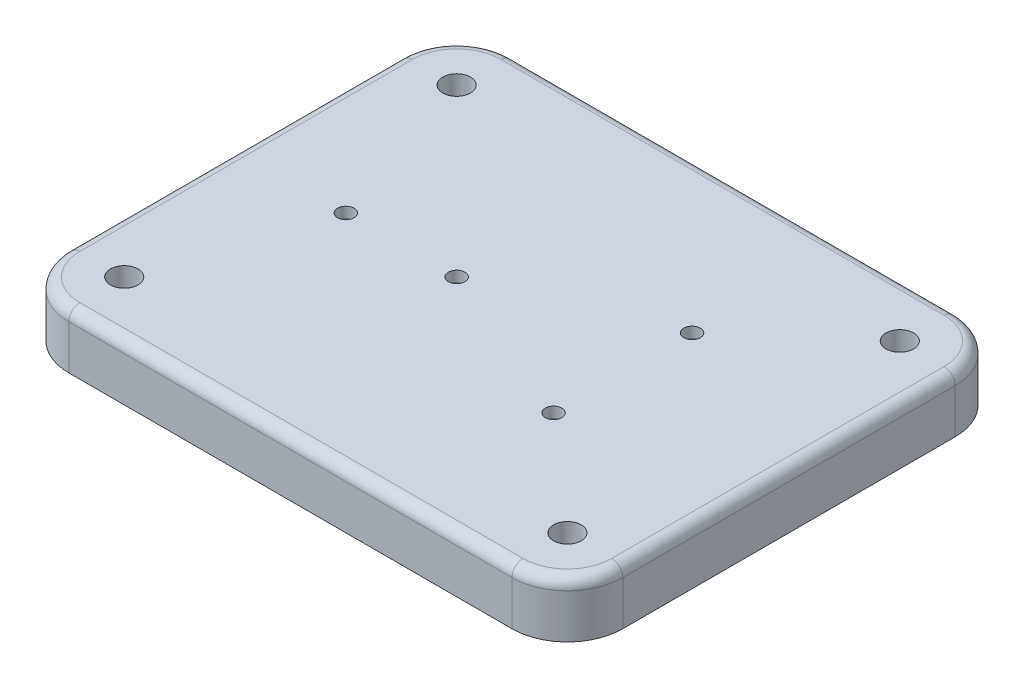
ISO-10303-21;
HEADER;
FILE_DESCRIPTION(('STEP AP214'),'2;1');
FILE_NAME('part.step','',(''),(''),'','','');
FILE_SCHEMA(('AUTOMOTIVE_DESIGN { 1 0 10303 214 1 1 1 1 }'));
ENDSEC;
DATA;
#1=APPLICATION_CONTEXT('core data for automotive mechanical design processes');
#2=APPLICATION_PROTOCOL_DEFINITION('international standard','automotive_design',2000,#1);
#3=PRODUCT_CONTEXT('',#1,'mechanical');
#4=PRODUCT('Part','Part','',(#3));
#5=PRODUCT_RELATED_PRODUCT_CATEGORY('part','',(#4));
#6=PRODUCT_DEFINITION_FORMATION('','',#4);
#7=PRODUCT_DEFINITION_CONTEXT('part definition',#1,'design');
#8=PRODUCT_DEFINITION('design','',#6,#7);
#9=PRODUCT_DEFINITION_SHAPE('','',#8);
#10=(LENGTH_UNIT() NAMED_UNIT(*) SI_UNIT(.MILLI.,.METRE.));
#11=(NAMED_UNIT(*) PLANE_ANGLE_UNIT() SI_UNIT($,.RADIAN.));
#12=(NAMED_UNIT(*) SI_UNIT($,.STERADIAN.) SOLID_ANGLE_UNIT());
#13=UNCERTAINTY_MEASURE_WITH_UNIT(LENGTH_MEASURE(1.E-05),#10,'distance_accuracy_value','');
#14=(GEOMETRIC_REPRESENTATION_CONTEXT(3) GLOBAL_UNCERTAINTY_ASSIGNED_CONTEXT((#13)) GLOBAL_UNIT_ASSIGNED_CONTEXT((#10,
#11,#12)) REPRESENTATION_CONTEXT('',''));
#15=CARTESIAN_POINT('',(0.,0.,0.));
#16=DIRECTION('',(0.,0.,1.));
#17=DIRECTION('',(1.,0.,0.));
#18=AXIS2_PLACEMENT_3D('',#15,#16,#17);
#19=CARTESIAN_POINT('',(0.,0.,0.));
#20=DIRECTION('',(0.,1.,0.));
#21=DIRECTION('',(0.,0.,1.));
#22=AXIS2_PLACEMENT_3D('',#19,#20,#21);
#23=PLANE('',#22);
#24=CARTESIAN_POINT('',(40.,0.,30.));
#25=DIRECTION('',(0.,1.,0.));
#26=DIRECTION('',(0.,0.,1.));
#27=AXIS2_PLACEMENT_3D('',#24,#25,#26);
#28=CIRCLE('',#27,4.5);
#29=CARTESIAN_POINT('',(40.,0.,34.5));
#30=VERTEX_POINT('',#29);
#31=EDGE_CURVE('E238',#30,#30,#28,.T.);
#32=ORIENTED_EDGE('',*,*,#31,.F.);
#33=EDGE_LOOP('',(#32));
#34=FACE_BOUND('',#33,.T.);
#35=CARTESIAN_POINT('',(40.,0.,30.));
#36=DIRECTION('',(0.,1.,0.));
#37=DIRECTION('',(0.,0.,1.));
#38=AXIS2_PLACEMENT_3D('',#35,#36,#37);
#39=CIRCLE('',#38,2.5);
#40=CARTESIAN_POINT('',(40.,0.,32.5));
#41=VERTEX_POINT('',#40);
#42=EDGE_CURVE('E325',#41,#41,#39,.T.);
#43=ORIENTED_EDGE('',*,*,#42,.T.);
#44=EDGE_LOOP('',(#43));
#45=FACE_BOUND('',#44,.T.);
#46=ADVANCED_FACE('F38',(#34,#45),#23,.F.);
#47=CARTESIAN_POINT('',(-40.,0.,30.));
#48=DIRECTION('',(0.,1.,0.));
#49=DIRECTION('',(0.,0.,1.));
#50=AXIS2_PLACEMENT_3D('',#47,#48,#49);
#51=CIRCLE('',#50,4.5);
#52=CARTESIAN_POINT('',(-40.,0.,34.5));
#53=VERTEX_POINT('',#52);
#54=EDGE_CURVE('E243',#53,#53,#51,.T.);
#55=ORIENTED_EDGE('',*,*,#54,.F.);
#56=EDGE_LOOP('',(#55));
#57=FACE_BOUND('',#56,.T.);
#58=CARTESIAN_POINT('',(-40.,0.,30.));
#59=DIRECTION('',(0.,1.,0.));
#60=DIRECTION('',(0.,0.,1.));
#61=AXIS2_PLACEMENT_3D('',#58,#59,#60);
#62=CIRCLE('',#61,2.5);
#63=CARTESIAN_POINT('',(-40.,0.,32.5));
#64=VERTEX_POINT('',#63);
#65=EDGE_CURVE('E317',#64,#64,#62,.T.);
#66=ORIENTED_EDGE('',*,*,#65,.T.);
#67=EDGE_LOOP('',(#66));
#68=FACE_BOUND('',#67,.T.);
#69=ADVANCED_FACE('F501',(#57,#68),#23,.F.);
#70=CARTESIAN_POINT('',(-40.,0.,-30.));
#71=DIRECTION('',(0.,1.,0.));
#72=DIRECTION('',(0.,0.,1.));
#73=AXIS2_PLACEMENT_3D('',#70,#71,#72);
#74=CIRCLE('',#73,4.5);
#75=CARTESIAN_POINT('',(-40.,0.,-25.5));
#76=VERTEX_POINT('',#75);
#77=EDGE_CURVE('E248',#76,#76,#74,.T.);
#78=ORIENTED_EDGE('',*,*,#77,.F.);
#79=EDGE_LOOP('',(#78));
#80=FACE_BOUND('',#79,.T.);
#81=CARTESIAN_POINT('',(-40.,0.,-30.));
#82=DIRECTION('',(0.,1.,0.));
#83=DIRECTION('',(0.,0.,1.));
#84=AXIS2_PLACEMENT_3D('',#81,#82,#83);
#85=CIRCLE('',#84,2.5);
#86=CARTESIAN_POINT('',(-40.,0.,-27.5));
#87=VERTEX_POINT('',#86);
#88=EDGE_CURVE('E308',#87,#87,#85,.T.);
#89=ORIENTED_EDGE('',*,*,#88,.T.);
#90=EDGE_LOOP('',(#89));
#91=FACE_BOUND('',#90,.T.);
#92=ADVANCED_FACE('F509',(#80,#91),#23,.F.);
#93=DIRECTION('',(-1.,0.,0.));
#94=VECTOR('',#93,1.);
#95=CARTESIAN_POINT('',(-50.,0.,-40.));
#96=LINE('',#95,#94);
#97=CARTESIAN_POINT('',(40.,0.,-40.));
#98=VERTEX_POINT('',#97);
#99=CARTESIAN_POINT('',(-40.,0.,-40.));
#100=VERTEX_POINT('',#99);
#101=EDGE_CURVE('E345',#98,#100,#96,.T.);
#102=ORIENTED_EDGE('',*,*,#101,.F.);
#103=CARTESIAN_POINT('',(40.,0.,-30.));
#104=DIRECTION('',(0.,1.,0.));
#105=DIRECTION('',(0.,0.,1.));
#106=AXIS2_PLACEMENT_3D('',#103,#104,#105);
#107=CIRCLE('',#106,10.);
#108=CARTESIAN_POINT('',(50.,0.,-30.));
#109=VERTEX_POINT('',#108);
#110=EDGE_CURVE('E372',#98,#109,#107,.F.);
#111=ORIENTED_EDGE('',*,*,#110,.T.);
#112=DIRECTION('',(0.,0.,-1.));
#113=VECTOR('',#112,1.);
#114=CARTESIAN_POINT('',(50.,0.,-40.));
#115=LINE('',#114,#113);
#116=CARTESIAN_POINT('',(50.,0.,30.));
#117=VERTEX_POINT('',#116);
#118=EDGE_CURVE('E338',#117,#109,#115,.T.);
#119=ORIENTED_EDGE('',*,*,#118,.F.);
#120=CARTESIAN_POINT('',(40.,0.,30.));
#121=DIRECTION('',(0.,1.,0.));
#122=DIRECTION('',(0.,0.,1.));
#123=AXIS2_PLACEMENT_3D('',#120,#121,#122);
#124=CIRCLE('',#123,10.);
#125=CARTESIAN_POINT('',(40.,0.,40.));
#126=VERTEX_POINT('',#125);
#127=EDGE_CURVE('E369',#117,#126,#124,.F.);
#128=ORIENTED_EDGE('',*,*,#127,.T.);
#129=DIRECTION('',(1.,0.,0.));
#130=VECTOR('',#129,1.);
#131=CARTESIAN_POINT('',(-50.,0.,40.));
#132=LINE('',#131,#130);
#133=CARTESIAN_POINT('',(-40.,0.,40.));
#134=VERTEX_POINT('',#133);
#135=EDGE_CURVE('E353',#134,#126,#132,.T.);
#136=ORIENTED_EDGE('',*,*,#135,.F.);
#137=CARTESIAN_POINT('',(-40.,0.,30.));
#138=DIRECTION('',(0.,1.,0.));
#139=DIRECTION('',(0.,0.,1.));
#140=AXIS2_PLACEMENT_3D('',#137,#138,#139);
#141=CIRCLE('',#140,10.);
#142=CARTESIAN_POINT('',(-50.,0.,30.));
#143=VERTEX_POINT('',#142);
#144=EDGE_CURVE('E366',#134,#143,#141,.F.);
#145=ORIENTED_EDGE('',*,*,#144,.T.);
#146=DIRECTION('',(0.,0.,1.));
#147=VECTOR('',#146,1.);
#148=CARTESIAN_POINT('',(-50.,0.,-40.));
#149=LINE('',#148,#147);
#150=CARTESIAN_POINT('',(-50.,0.,-30.));
#151=VERTEX_POINT('',#150);
#152=EDGE_CURVE('E349',#151,#143,#149,.T.);
#153=ORIENTED_EDGE('',*,*,#152,.F.);
#154=CARTESIAN_POINT('',(-40.,0.,-30.));
#155=DIRECTION('',(0.,1.,0.));
#156=DIRECTION('',(0.,0.,1.));
#157=AXIS2_PLACEMENT_3D('',#154,#155,#156);
#158=CIRCLE('',#157,10.);
#159=EDGE_CURVE('E363',#151,#100,#158,.F.);
#160=ORIENTED_EDGE('',*,*,#159,.T.);
#161=EDGE_LOOP('',(#102,#111,#119,#128,#136,#145,#153,#160));
#162=FACE_BOUND('',#161,.T.);
#163=CARTESIAN_POINT('',(40.,0.,-30.));
#164=DIRECTION('',(0.,1.,0.));
#165=DIRECTION('',(0.,0.,1.));
#166=AXIS2_PLACEMENT_3D('',#163,#164,#165);
#167=CIRCLE('',#166,8.);
#168=CARTESIAN_POINT('',(40.,0.,-38.));
#169=VERTEX_POINT('',#168);
#170=CARTESIAN_POINT('',(48.,0.,-30.));
#171=VERTEX_POINT('',#170);
#172=EDGE_CURVE('E185',#169,#171,#167,.F.);
#173=ORIENTED_EDGE('',*,*,#172,.F.);
#174=DIRECTION('',(-1.,0.,0.));
#175=VECTOR('',#174,1.);
#176=CARTESIAN_POINT('',(-50.,0.,-38.));
#177=LINE('',#176,#175);
#178=CARTESIAN_POINT('',(-40.,0.,-38.));
#179=VERTEX_POINT('',#178);
#180=EDGE_CURVE('E277',#169,#179,#177,.T.);
#181=ORIENTED_EDGE('',*,*,#180,.T.);
#182=CARTESIAN_POINT('',(-40.,0.,-30.));
#183=DIRECTION('',(0.,1.,0.));
#184=DIRECTION('',(0.,0.,1.));
#185=AXIS2_PLACEMENT_3D('',#182,#183,#184);
#186=CIRCLE('',#185,8.);
#187=CARTESIAN_POINT('',(-48.,0.,-30.));
#188=VERTEX_POINT('',#187);
#189=EDGE_CURVE('E262',#188,#179,#186,.F.);
#190=ORIENTED_EDGE('',*,*,#189,.F.);
#191=DIRECTION('',(0.,0.,1.));
#192=VECTOR('',#191,1.);
#193=CARTESIAN_POINT('',(-48.,0.,-40.));
#194=LINE('',#193,#192);
#195=CARTESIAN_POINT('',(-48.,0.,30.));
#196=VERTEX_POINT('',#195);
#197=EDGE_CURVE('E56',#188,#196,#194,.T.);
#198=ORIENTED_EDGE('',*,*,#197,.T.);
#199=CARTESIAN_POINT('',(-40.,0.,30.));
#200=DIRECTION('',(0.,1.,0.));
#201=DIRECTION('',(0.,0.,1.));
#202=AXIS2_PLACEMENT_3D('',#199,#200,#201);
#203=CIRCLE('',#202,8.);
#204=CARTESIAN_POINT('',(-40.,0.,38.));
#205=VERTEX_POINT('',#204);
#206=EDGE_CURVE('E281',#205,#196,#203,.F.);
#207=ORIENTED_EDGE('',*,*,#206,.F.);
#208=DIRECTION('',(1.,0.,0.));
#209=VECTOR('',#208,1.);
#210=CARTESIAN_POINT('',(-50.,0.,38.));
#211=LINE('',#210,#209);
#212=CARTESIAN_POINT('',(40.,0.,38.));
#213=VERTEX_POINT('',#212);
#214=EDGE_CURVE('E259',#205,#213,#211,.T.);
#215=ORIENTED_EDGE('',*,*,#214,.T.);
#216=CARTESIAN_POINT('',(40.,0.,30.));
#217=DIRECTION('',(0.,1.,0.));
#218=DIRECTION('',(0.,0.,1.));
#219=AXIS2_PLACEMENT_3D('',#216,#217,#218);
#220=CIRCLE('',#219,8.);
#221=CARTESIAN_POINT('',(48.,0.,30.));
#222=VERTEX_POINT('',#221);
#223=EDGE_CURVE('E278',#222,#213,#220,.F.);
#224=ORIENTED_EDGE('',*,*,#223,.F.);
#225=DIRECTION('',(0.,0.,-1.));
#226=VECTOR('',#225,1.);
#227=CARTESIAN_POINT('',(48.,0.,-40.));
#228=LINE('',#227,#226);
#229=EDGE_CURVE('E274',#222,#171,#228,.T.);
#230=ORIENTED_EDGE('',*,*,#229,.T.);
#231=EDGE_LOOP('',(#173,#181,#190,#198,#207,#215,#224,#230));
#232=FACE_BOUND('',#231,.T.);
#233=ADVANCED_FACE('F519',(#162,#232),#23,.F.);
#234=CARTESIAN_POINT('',(50.,10.,-40.));
#235=DIRECTION('',(-1.,0.,0.));
#236=DIRECTION('',(0.,0.,1.));
#237=AXIS2_PLACEMENT_3D('',#234,#235,#236);
#238=PLANE('',#237);
#239=DIRECTION('',(0.,-1.,0.));
#240=VECTOR('',#239,1.);
#241=CARTESIAN_POINT('',(50.,10.,-30.));
#242=LINE('',#241,#240);
#243=CARTESIAN_POINT('',(50.,8.,-30.));
#244=VERTEX_POINT('',#243);
#245=EDGE_CURVE('E378',#109,#244,#242,.F.);
#246=ORIENTED_EDGE('',*,*,#245,.T.);
#247=DIRECTION('',(0.,0.,-1.));
#248=VECTOR('',#247,1.);
#249=CARTESIAN_POINT('',(50.,8.,30.));
#250=LINE('',#249,#248);
#251=CARTESIAN_POINT('',(50.,8.,30.));
#252=VERTEX_POINT('',#251);
#253=EDGE_CURVE('E425',#244,#252,#250,.F.);
#254=ORIENTED_EDGE('',*,*,#253,.T.);
#255=DIRECTION('',(0.,-1.,0.));
#256=VECTOR('',#255,1.);
#257=CARTESIAN_POINT('',(50.,10.,30.));
#258=LINE('',#257,#256);
#259=EDGE_CURVE('E375',#252,#117,#258,.T.);
#260=ORIENTED_EDGE('',*,*,#259,.T.);
#261=ORIENTED_EDGE('',*,*,#118,.T.);
#262=EDGE_LOOP('',(#246,#254,#260,#261));
#263=FACE_BOUND('',#262,.T.);
#264=ADVANCED_FACE('F533',(#263),#238,.F.);
#265=CARTESIAN_POINT('',(-50.,10.,-40.));
#266=DIRECTION('',(0.,0.,1.));
#267=DIRECTION('',(1.,0.,0.));
#268=AXIS2_PLACEMENT_3D('',#265,#266,#267);
#269=PLANE('',#268);
#270=DIRECTION('',(0.,-1.,0.));
#271=VECTOR('',#270,1.);
#272=CARTESIAN_POINT('',(-40.,10.,-40.));
#273=LINE('',#272,#271);
#274=CARTESIAN_POINT('',(-40.,8.,-40.));
#275=VERTEX_POINT('',#274);
#276=EDGE_CURVE('E357',#100,#275,#273,.F.);
#277=ORIENTED_EDGE('',*,*,#276,.T.);
#278=DIRECTION('',(-1.,0.,0.));
#279=VECTOR('',#278,1.);
#280=CARTESIAN_POINT('',(40.,8.,-40.));
#281=LINE('',#280,#279);
#282=CARTESIAN_POINT('',(40.,8.,-40.));
#283=VERTEX_POINT('',#282);
#284=EDGE_CURVE('E11',#275,#283,#281,.F.);
#285=ORIENTED_EDGE('',*,*,#284,.T.);
#286=DIRECTION('',(0.,-1.,0.));
#287=VECTOR('',#286,1.);
#288=CARTESIAN_POINT('',(40.,10.,-40.));
#289=LINE('',#288,#287);
#290=EDGE_CURVE('E360',#283,#98,#289,.T.);
#291=ORIENTED_EDGE('',*,*,#290,.T.);
#292=ORIENTED_EDGE('',*,*,#101,.T.);
#293=EDGE_LOOP('',(#277,#285,#291,#292));
#294=FACE_BOUND('',#293,.T.);
#295=ADVANCED_FACE('F539',(#294),#269,.F.);
#296=CARTESIAN_POINT('',(-50.,10.,-40.));
#297=DIRECTION('',(1.,0.,0.));
#298=DIRECTION('',(0.,0.,-1.));
#299=AXIS2_PLACEMENT_3D('',#296,#297,#298);
#300=PLANE('',#299);
#301=DIRECTION('',(0.,-1.,0.));
#302=VECTOR('',#301,1.);
#303=CARTESIAN_POINT('',(-50.,10.,30.));
#304=LINE('',#303,#302);
#305=CARTESIAN_POINT('',(-50.,8.,30.));
#306=VERTEX_POINT('',#305);
#307=EDGE_CURVE('E392',#143,#306,#304,.F.);
#308=ORIENTED_EDGE('',*,*,#307,.T.);
#309=DIRECTION('',(0.,0.,1.));
#310=VECTOR('',#309,1.);
#311=CARTESIAN_POINT('',(-50.,8.,-30.));
#312=LINE('',#311,#310);
#313=CARTESIAN_POINT('',(-50.,8.,-30.));
#314=VERTEX_POINT('',#313);
#315=EDGE_CURVE('E437',#306,#314,#312,.F.);
#316=ORIENTED_EDGE('',*,*,#315,.T.);
#317=DIRECTION('',(0.,-1.,0.));
#318=VECTOR('',#317,1.);
#319=CARTESIAN_POINT('',(-50.,10.,-30.));
#320=LINE('',#319,#318);
#321=EDGE_CURVE('E389',#314,#151,#320,.T.);
#322=ORIENTED_EDGE('',*,*,#321,.T.);
#323=ORIENTED_EDGE('',*,*,#152,.T.);
#324=EDGE_LOOP('',(#308,#316,#322,#323));
#325=FACE_BOUND('',#324,.T.);
#326=ADVANCED_FACE('F678',(#325),#300,.F.);
#327=CARTESIAN_POINT('',(-50.,10.,40.));
#328=DIRECTION('',(0.,0.,-1.));
#329=DIRECTION('',(-1.,0.,0.));
#330=AXIS2_PLACEMENT_3D('',#327,#328,#329);
#331=PLANE('',#330);
#332=DIRECTION('',(0.,-1.,0.));
#333=VECTOR('',#332,1.);
#334=CARTESIAN_POINT('',(40.,10.,40.));
#335=LINE('',#334,#333);
#336=CARTESIAN_POINT('',(40.,8.,40.));
#337=VERTEX_POINT('',#336);
#338=EDGE_CURVE('E385',#126,#337,#335,.F.);
#339=ORIENTED_EDGE('',*,*,#338,.T.);
#340=DIRECTION('',(1.,0.,0.));
#341=VECTOR('',#340,1.);
#342=CARTESIAN_POINT('',(-40.,8.,40.));
#343=LINE('',#342,#341);
#344=CARTESIAN_POINT('',(-40.,8.,40.));
#345=VERTEX_POINT('',#344);
#346=EDGE_CURVE('E431',#337,#345,#343,.F.);
#347=ORIENTED_EDGE('',*,*,#346,.T.);
#348=DIRECTION('',(0.,-1.,0.));
#349=VECTOR('',#348,1.);
#350=CARTESIAN_POINT('',(-40.,10.,40.));
#351=LINE('',#350,#349);
#352=EDGE_CURVE('E382',#345,#134,#351,.T.);
#353=ORIENTED_EDGE('',*,*,#352,.T.);
#354=ORIENTED_EDGE('',*,*,#135,.T.);
#355=EDGE_LOOP('',(#339,#347,#353,#354));
#356=FACE_BOUND('',#355,.T.);
#357=ADVANCED_FACE('F529',(#356),#331,.F.);
#358=CARTESIAN_POINT('',(0.,10.,0.));
#359=DIRECTION('',(0.,1.,0.));
#360=DIRECTION('',(0.,0.,1.));
#361=AXIS2_PLACEMENT_3D('',#358,#359,#360);
#362=PLANE('',#361);
#363=CARTESIAN_POINT('',(20.,10.,-12.5));
#364=DIRECTION('',(0.,1.,0.));
#365=DIRECTION('',(0.,0.,1.));
#366=AXIS2_PLACEMENT_3D('',#363,#364,#365);
#367=CIRCLE('',#366,1.5);
#368=CARTESIAN_POINT('',(20.,10.,-11.));
#369=VERTEX_POINT('',#368);
#370=EDGE_CURVE('E475',#369,#369,#367,.T.);
#371=ORIENTED_EDGE('',*,*,#370,.F.);
#372=EDGE_LOOP('',(#371));
#373=FACE_BOUND('',#372,.T.);
#374=CARTESIAN_POINT('',(20.,10.,12.5));
#375=DIRECTION('',(0.,1.,0.));
#376=DIRECTION('',(0.,0.,1.));
#377=AXIS2_PLACEMENT_3D('',#374,#375,#376);
#378=CIRCLE('',#377,1.5);
#379=CARTESIAN_POINT('',(20.,10.,14.));
#380=VERTEX_POINT('',#379);
#381=EDGE_CURVE('E900',#380,#380,#378,.T.);
#382=ORIENTED_EDGE('',*,*,#381,.F.);
#383=EDGE_LOOP('',(#382));
#384=FACE_BOUND('',#383,.T.);
#385=CARTESIAN_POINT('',(-10.,10.,0.));
#386=DIRECTION('',(0.,1.,0.));
#387=DIRECTION('',(0.,0.,1.));
#388=AXIS2_PLACEMENT_3D('',#385,#386,#387);
#389=CIRCLE('',#388,1.5);
#390=CARTESIAN_POINT('',(-10.,10.,1.5));
#391=VERTEX_POINT('',#390);
#392=EDGE_CURVE('E892',#391,#391,#389,.T.);
#393=ORIENTED_EDGE('',*,*,#392,.F.);
#394=EDGE_LOOP('',(#393));
#395=FACE_BOUND('',#394,.T.);
#396=CARTESIAN_POINT('',(-30.,10.,0.));
#397=DIRECTION('',(0.,1.,0.));
#398=DIRECTION('',(0.,0.,1.));
#399=AXIS2_PLACEMENT_3D('',#396,#397,#398);
#400=CIRCLE('',#399,1.5);
#401=CARTESIAN_POINT('',(-30.,10.,1.50000000000001));
#402=VERTEX_POINT('',#401);
#403=EDGE_CURVE('E901',#402,#402,#400,.T.);
#404=ORIENTED_EDGE('',*,*,#403,.F.);
#405=EDGE_LOOP('',(#404));
#406=FACE_BOUND('',#405,.T.);
#407=DIRECTION('',(0.,0.,-1.));
#408=VECTOR('',#407,1.);
#409=CARTESIAN_POINT('',(48.,10.,-30.));
#410=LINE('',#409,#408);
#411=CARTESIAN_POINT('',(48.,10.,30.));
#412=VERTEX_POINT('',#411);
#413=CARTESIAN_POINT('',(48.,10.,-30.));
#414=VERTEX_POINT('',#413);
#415=EDGE_CURVE('E414',#412,#414,#410,.T.);
#416=ORIENTED_EDGE('',*,*,#415,.T.);
#417=CARTESIAN_POINT('',(40.,10.,-30.));
#418=DIRECTION('',(0.,1.,0.));
#419=DIRECTION('',(0.,0.,1.));
#420=AXIS2_PLACEMENT_3D('',#417,#418,#419);
#421=CIRCLE('',#420,8.);
#422=CARTESIAN_POINT('',(40.,10.,-38.));
#423=VERTEX_POINT('',#422);
#424=EDGE_CURVE('E417',#414,#423,#421,.T.);
#425=ORIENTED_EDGE('',*,*,#424,.T.);
#426=DIRECTION('',(-1.,0.,0.));
#427=VECTOR('',#426,1.);
#428=CARTESIAN_POINT('',(-40.,10.,-38.));
#429=LINE('',#428,#427);
#430=CARTESIAN_POINT('',(-40.,10.,-38.));
#431=VERTEX_POINT('',#430);
#432=EDGE_CURVE('E396',#423,#431,#429,.T.);
#433=ORIENTED_EDGE('',*,*,#432,.T.);
#434=CARTESIAN_POINT('',(-40.,10.,-30.));
#435=DIRECTION('',(0.,1.,0.));
#436=DIRECTION('',(0.,0.,1.));
#437=AXIS2_PLACEMENT_3D('',#434,#435,#436);
#438=CIRCLE('',#437,8.);
#439=CARTESIAN_POINT('',(-48.,10.,-30.));
#440=VERTEX_POINT('',#439);
#441=EDGE_CURVE('E399',#431,#440,#438,.T.);
#442=ORIENTED_EDGE('',*,*,#441,.T.);
#443=DIRECTION('',(0.,0.,1.));
#444=VECTOR('',#443,1.);
#445=CARTESIAN_POINT('',(-48.,10.,30.));
#446=LINE('',#445,#444);
#447=CARTESIAN_POINT('',(-48.,10.,30.));
#448=VERTEX_POINT('',#447);
#449=EDGE_CURVE('E402',#440,#448,#446,.T.);
#450=ORIENTED_EDGE('',*,*,#449,.T.);
#451=CARTESIAN_POINT('',(-40.,10.,30.));
#452=DIRECTION('',(0.,1.,0.));
#453=DIRECTION('',(0.,0.,1.));
#454=AXIS2_PLACEMENT_3D('',#451,#452,#453);
#455=CIRCLE('',#454,8.);
#456=CARTESIAN_POINT('',(-40.,10.,38.));
#457=VERTEX_POINT('',#456);
#458=EDGE_CURVE('E405',#448,#457,#455,.T.);
#459=ORIENTED_EDGE('',*,*,#458,.T.);
#460=DIRECTION('',(1.,0.,0.));
#461=VECTOR('',#460,1.);
#462=CARTESIAN_POINT('',(40.,10.,38.));
#463=LINE('',#462,#461);
#464=CARTESIAN_POINT('',(40.,10.,38.));
#465=VERTEX_POINT('',#464);
#466=EDGE_CURVE('E408',#457,#465,#463,.T.);
#467=ORIENTED_EDGE('',*,*,#466,.T.);
#468=CARTESIAN_POINT('',(40.,10.,30.));
#469=DIRECTION('',(0.,1.,0.));
#470=DIRECTION('',(0.,0.,1.));
#471=AXIS2_PLACEMENT_3D('',#468,#469,#470);
#472=CIRCLE('',#471,8.);
#473=EDGE_CURVE('E411',#465,#412,#472,.T.);
#474=ORIENTED_EDGE('',*,*,#473,.T.);
#475=EDGE_LOOP('',(#416,#425,#433,#442,#450,#459,#467,#474));
#476=FACE_BOUND('',#475,.T.);
#477=CARTESIAN_POINT('',(40.,10.,30.));
#478=DIRECTION('',(0.,1.,0.));
#479=DIRECTION('',(0.,0.,1.));
#480=AXIS2_PLACEMENT_3D('',#477,#478,#479);
#481=CIRCLE('',#480,2.5);
#482=CARTESIAN_POINT('',(40.,10.,32.5));
#483=VERTEX_POINT('',#482);
#484=EDGE_CURVE('E329',#483,#483,#481,.T.);
#485=ORIENTED_EDGE('',*,*,#484,.F.);
#486=EDGE_LOOP('',(#485));
#487=FACE_BOUND('',#486,.T.);
#488=CARTESIAN_POINT('',(-40.,10.,30.));
#489=DIRECTION('',(0.,1.,0.));
#490=DIRECTION('',(0.,0.,1.));
#491=AXIS2_PLACEMENT_3D('',#488,#489,#490);
#492=CIRCLE('',#491,2.5);
#493=CARTESIAN_POINT('',(-40.,10.,32.5));
#494=VERTEX_POINT('',#493);
#495=EDGE_CURVE('E321',#494,#494,#492,.T.);
#496=ORIENTED_EDGE('',*,*,#495,.F.);
#497=EDGE_LOOP('',(#496));
#498=FACE_BOUND('',#497,.T.);
#499=CARTESIAN_POINT('',(-40.,10.,-30.));
#500=DIRECTION('',(0.,1.,0.));
#501=DIRECTION('',(0.,0.,1.));
#502=AXIS2_PLACEMENT_3D('',#499,#500,#501);
#503=CIRCLE('',#502,2.5);
#504=CARTESIAN_POINT('',(-40.,10.,-27.5));
#505=VERTEX_POINT('',#504);
#506=EDGE_CURVE('E313',#505,#505,#503,.T.);
#507=ORIENTED_EDGE('',*,*,#506,.F.);
#508=EDGE_LOOP('',(#507));
#509=FACE_BOUND('',#508,.T.);
#510=CARTESIAN_POINT('',(40.,10.,-30.));
#511=DIRECTION('',(0.,1.,0.));
#512=DIRECTION('',(0.,0.,1.));
#513=AXIS2_PLACEMENT_3D('',#510,#511,#512);
#514=CIRCLE('',#513,2.5);
#515=CARTESIAN_POINT('',(40.,10.,-27.5));
#516=VERTEX_POINT('',#515);
#517=EDGE_CURVE('E312',#516,#516,#514,.T.);
#518=ORIENTED_EDGE('',*,*,#517,.F.);
#519=EDGE_LOOP('',(#518));
#520=FACE_BOUND('',#519,.T.);
#521=ADVANCED_FACE('F517',(#373,#384,#395,#406,#476,#487,#498,#509,#520),#362,.T.);
#522=CARTESIAN_POINT('',(40.,0.,-30.));
#523=DIRECTION('',(0.,1.,0.));
#524=DIRECTION('',(0.,0.,1.));
#525=AXIS2_PLACEMENT_3D('',#522,#523,#524);
#526=CIRCLE('',#525,4.5);
#527=CARTESIAN_POINT('',(40.,0.,-25.5));
#528=VERTEX_POINT('',#527);
#529=EDGE_CURVE('E253',#528,#528,#526,.T.);
#530=ORIENTED_EDGE('',*,*,#529,.F.);
#531=EDGE_LOOP('',(#530));
#532=FACE_BOUND('',#531,.T.);
#533=CARTESIAN_POINT('',(40.,0.,-30.));
#534=DIRECTION('',(0.,1.,0.));
#535=DIRECTION('',(0.,0.,1.));
#536=AXIS2_PLACEMENT_3D('',#533,#534,#535);
#537=CIRCLE('',#536,2.5);
#538=CARTESIAN_POINT('',(40.,0.,-27.5));
#539=VERTEX_POINT('',#538);
#540=EDGE_CURVE('E334',#539,#539,#537,.T.);
#541=ORIENTED_EDGE('',*,*,#540,.T.);
#542=EDGE_LOOP('',(#541));
#543=FACE_BOUND('',#542,.T.);
#544=ADVANCED_FACE('F504',(#532,#543),#23,.F.);
#545=CARTESIAN_POINT('',(40.,10.,-30.));
#546=DIRECTION('',(0.,-1.,0.));
#547=DIRECTION('',(0.,0.,-1.));
#548=AXIS2_PLACEMENT_3D('',#545,#546,#547);
#549=CYLINDRICAL_SURFACE('',#548,10.);
#550=ORIENTED_EDGE('',*,*,#290,.F.);
#551=CARTESIAN_POINT('',(40.,8.,-30.));
#552=DIRECTION('',(0.,1.,0.));
#553=DIRECTION('',(0.,0.,1.));
#554=AXIS2_PLACEMENT_3D('',#551,#552,#553);
#555=CIRCLE('',#554,10.);
#556=EDGE_CURVE('E421',#283,#244,#555,.F.);
#557=ORIENTED_EDGE('',*,*,#556,.T.);
#558=ORIENTED_EDGE('',*,*,#245,.F.);
#559=ORIENTED_EDGE('',*,*,#110,.F.);
#560=EDGE_LOOP('',(#550,#557,#558,#559));
#561=FACE_BOUND('',#560,.T.);
#562=ADVANCED_FACE('F516',(#561),#549,.T.);
#563=CARTESIAN_POINT('',(40.,10.,30.));
#564=DIRECTION('',(0.,-1.,0.));
#565=DIRECTION('',(0.,0.,-1.));
#566=AXIS2_PLACEMENT_3D('',#563,#564,#565);
#567=CYLINDRICAL_SURFACE('',#566,10.);
#568=ORIENTED_EDGE('',*,*,#259,.F.);
#569=CARTESIAN_POINT('',(40.,8.,30.));
#570=DIRECTION('',(0.,1.,0.));
#571=DIRECTION('',(0.,0.,1.));
#572=AXIS2_PLACEMENT_3D('',#569,#570,#571);
#573=CIRCLE('',#572,10.);
#574=EDGE_CURVE('E428',#252,#337,#573,.F.);
#575=ORIENTED_EDGE('',*,*,#574,.T.);
#576=ORIENTED_EDGE('',*,*,#338,.F.);
#577=ORIENTED_EDGE('',*,*,#127,.F.);
#578=EDGE_LOOP('',(#568,#575,#576,#577));
#579=FACE_BOUND('',#578,.T.);
#580=ADVANCED_FACE('F525',(#579),#567,.T.);
#581=CARTESIAN_POINT('',(-40.,10.,30.));
#582=DIRECTION('',(0.,-1.,0.));
#583=DIRECTION('',(0.,0.,-1.));
#584=AXIS2_PLACEMENT_3D('',#581,#582,#583);
#585=CYLINDRICAL_SURFACE('',#584,10.);
#586=ORIENTED_EDGE('',*,*,#352,.F.);
#587=CARTESIAN_POINT('',(-40.,8.,30.));
#588=DIRECTION('',(0.,1.,0.));
#589=DIRECTION('',(0.,0.,1.));
#590=AXIS2_PLACEMENT_3D('',#587,#588,#589);
#591=CIRCLE('',#590,10.);
#592=EDGE_CURVE('E434',#345,#306,#591,.F.);
#593=ORIENTED_EDGE('',*,*,#592,.T.);
#594=ORIENTED_EDGE('',*,*,#307,.F.);
#595=ORIENTED_EDGE('',*,*,#144,.F.);
#596=EDGE_LOOP('',(#586,#593,#594,#595));
#597=FACE_BOUND('',#596,.T.);
#598=ADVANCED_FACE('F624',(#597),#585,.T.);
#599=CARTESIAN_POINT('',(-40.,10.,-30.));
#600=DIRECTION('',(0.,-1.,0.));
#601=DIRECTION('',(0.,0.,-1.));
#602=AXIS2_PLACEMENT_3D('',#599,#600,#601);
#603=CYLINDRICAL_SURFACE('',#602,10.);
#604=ORIENTED_EDGE('',*,*,#321,.F.);
#605=CARTESIAN_POINT('',(-40.,8.,-30.));
#606=DIRECTION('',(0.,1.,0.));
#607=DIRECTION('',(0.,0.,1.));
#608=AXIS2_PLACEMENT_3D('',#605,#606,#607);
#609=CIRCLE('',#608,10.);
#610=EDGE_CURVE('E48',#314,#275,#609,.F.);
#611=ORIENTED_EDGE('',*,*,#610,.T.);
#612=ORIENTED_EDGE('',*,*,#276,.F.);
#613=ORIENTED_EDGE('',*,*,#159,.F.);
#614=EDGE_LOOP('',(#604,#611,#612,#613));
#615=FACE_BOUND('',#614,.T.);
#616=ADVANCED_FACE('F619',(#615),#603,.T.);
#617=CARTESIAN_POINT('',(40.,0.,-30.));
#618=DIRECTION('',(0.,1.,0.));
#619=DIRECTION('',(0.,0.,1.));
#620=AXIS2_PLACEMENT_3D('',#617,#618,#619);
#621=CYLINDRICAL_SURFACE('',#620,2.5);
#622=ORIENTED_EDGE('',*,*,#540,.F.);
#623=EDGE_LOOP('',(#622));
#624=FACE_BOUND('',#623,.T.);
#625=ORIENTED_EDGE('',*,*,#517,.T.);
#626=EDGE_LOOP('',(#625));
#627=FACE_BOUND('',#626,.T.);
#628=ADVANCED_FACE('F609',(#624,#627),#621,.F.);
#629=CARTESIAN_POINT('',(-40.,0.,-30.));
#630=DIRECTION('',(0.,1.,0.));
#631=DIRECTION('',(0.,0.,1.));
#632=AXIS2_PLACEMENT_3D('',#629,#630,#631);
#633=CYLINDRICAL_SURFACE('',#632,2.5);
#634=ORIENTED_EDGE('',*,*,#88,.F.);
#635=EDGE_LOOP('',(#634));
#636=FACE_BOUND('',#635,.T.);
#637=ORIENTED_EDGE('',*,*,#506,.T.);
#638=EDGE_LOOP('',(#637));
#639=FACE_BOUND('',#638,.T.);
#640=ADVANCED_FACE('F605',(#636,#639),#633,.F.);
#641=CARTESIAN_POINT('',(-40.,0.,30.));
#642=DIRECTION('',(0.,1.,0.));
#643=DIRECTION('',(0.,0.,1.));
#644=AXIS2_PLACEMENT_3D('',#641,#642,#643);
#645=CYLINDRICAL_SURFACE('',#644,2.5);
#646=ORIENTED_EDGE('',*,*,#65,.F.);
#647=EDGE_LOOP('',(#646));
#648=FACE_BOUND('',#647,.T.);
#649=ORIENTED_EDGE('',*,*,#495,.T.);
#650=EDGE_LOOP('',(#649));
#651=FACE_BOUND('',#650,.T.);
#652=ADVANCED_FACE('F608',(#648,#651),#645,.F.);
#653=CARTESIAN_POINT('',(40.,0.,30.));
#654=DIRECTION('',(0.,1.,0.));
#655=DIRECTION('',(0.,0.,1.));
#656=AXIS2_PLACEMENT_3D('',#653,#654,#655);
#657=CYLINDRICAL_SURFACE('',#656,2.5);
#658=ORIENTED_EDGE('',*,*,#42,.F.);
#659=EDGE_LOOP('',(#658));
#660=FACE_BOUND('',#659,.T.);
#661=ORIENTED_EDGE('',*,*,#484,.T.);
#662=EDGE_LOOP('',(#661));
#663=FACE_BOUND('',#662,.T.);
#664=ADVANCED_FACE('F613',(#660,#663),#657,.F.);
#665=CARTESIAN_POINT('',(-40.,8.,30.));
#666=DIRECTION('',(0.,1.,0.));
#667=DIRECTION('',(0.,0.,1.));
#668=AXIS2_PLACEMENT_3D('',#665,#666,#667);
#669=TOROIDAL_SURFACE('',#668,8.,2.);
#670=CARTESIAN_POINT('',(-48.,8.,30.));
#671=DIRECTION('',(0.,0.,-1.));
#672=DIRECTION('',(-1.,0.,0.));
#673=AXIS2_PLACEMENT_3D('',#670,#671,#672);
#674=CIRCLE('',#673,2.);
#675=EDGE_CURVE('E463',#306,#448,#674,.T.);
#676=ORIENTED_EDGE('',*,*,#675,.F.);
#677=ORIENTED_EDGE('',*,*,#592,.F.);
#678=CARTESIAN_POINT('',(-40.,8.,38.));
#679=DIRECTION('',(1.,0.,0.));
#680=DIRECTION('',(0.,0.,-1.));
#681=AXIS2_PLACEMENT_3D('',#678,#679,#680);
#682=CIRCLE('',#681,2.);
#683=EDGE_CURVE('E333',#457,#345,#682,.T.);
#684=ORIENTED_EDGE('',*,*,#683,.F.);
#685=ORIENTED_EDGE('',*,*,#458,.F.);
#686=EDGE_LOOP('',(#676,#677,#684,#685));
#687=FACE_BOUND('',#686,.T.);
#688=ADVANCED_FACE('F40',(#687),#669,.T.);
#689=CARTESIAN_POINT('',(0.,8.,38.));
#690=DIRECTION('',(-1.,0.,0.));
#691=DIRECTION('',(0.,0.,1.));
#692=AXIS2_PLACEMENT_3D('',#689,#690,#691);
#693=CYLINDRICAL_SURFACE('',#692,2.);
#694=ORIENTED_EDGE('',*,*,#683,.T.);
#695=ORIENTED_EDGE('',*,*,#346,.F.);
#696=CARTESIAN_POINT('',(40.,8.,38.));
#697=DIRECTION('',(1.,0.,0.));
#698=DIRECTION('',(0.,0.,-1.));
#699=AXIS2_PLACEMENT_3D('',#696,#697,#698);
#700=CIRCLE('',#699,2.);
#701=EDGE_CURVE('E459',#465,#337,#700,.T.);
#702=ORIENTED_EDGE('',*,*,#701,.F.);
#703=ORIENTED_EDGE('',*,*,#466,.F.);
#704=EDGE_LOOP('',(#694,#695,#702,#703));
#705=FACE_BOUND('',#704,.T.);
#706=ADVANCED_FACE('F658',(#705),#693,.T.);
#707=CARTESIAN_POINT('',(-48.,8.,0.));
#708=DIRECTION('',(0.,0.,-1.));
#709=DIRECTION('',(-1.,0.,0.));
#710=AXIS2_PLACEMENT_3D('',#707,#708,#709);
#711=CYLINDRICAL_SURFACE('',#710,2.);
#712=ORIENTED_EDGE('',*,*,#675,.T.);
#713=ORIENTED_EDGE('',*,*,#449,.F.);
#714=CARTESIAN_POINT('',(-48.,8.,-30.));
#715=DIRECTION('',(0.,0.,-1.));
#716=DIRECTION('',(-1.,0.,0.));
#717=AXIS2_PLACEMENT_3D('',#714,#715,#716);
#718=CIRCLE('',#717,2.);
#719=EDGE_CURVE('E455',#314,#440,#718,.T.);
#720=ORIENTED_EDGE('',*,*,#719,.F.);
#721=ORIENTED_EDGE('',*,*,#315,.F.);
#722=EDGE_LOOP('',(#712,#713,#720,#721));
#723=FACE_BOUND('',#722,.T.);
#724=ADVANCED_FACE('F655',(#723),#711,.T.);
#725=CARTESIAN_POINT('',(40.,8.,30.));
#726=DIRECTION('',(0.,1.,0.));
#727=DIRECTION('',(0.,0.,1.));
#728=AXIS2_PLACEMENT_3D('',#725,#726,#727);
#729=TOROIDAL_SURFACE('',#728,8.,2.);
#730=ORIENTED_EDGE('',*,*,#701,.T.);
#731=ORIENTED_EDGE('',*,*,#574,.F.);
#732=CARTESIAN_POINT('',(48.,8.,30.));
#733=DIRECTION('',(0.,0.,-1.));
#734=DIRECTION('',(-1.,0.,0.));
#735=AXIS2_PLACEMENT_3D('',#732,#733,#734);
#736=CIRCLE('',#735,2.);
#737=EDGE_CURVE('E451',#412,#252,#736,.T.);
#738=ORIENTED_EDGE('',*,*,#737,.F.);
#739=ORIENTED_EDGE('',*,*,#473,.F.);
#740=EDGE_LOOP('',(#730,#731,#738,#739));
#741=FACE_BOUND('',#740,.T.);
#742=ADVANCED_FACE('F651',(#741),#729,.T.);
#743=CARTESIAN_POINT('',(-40.,8.,-30.));
#744=DIRECTION('',(0.,1.,0.));
#745=DIRECTION('',(0.,0.,1.));
#746=AXIS2_PLACEMENT_3D('',#743,#744,#745);
#747=TOROIDAL_SURFACE('',#746,8.,2.);
#748=ORIENTED_EDGE('',*,*,#719,.T.);
#749=ORIENTED_EDGE('',*,*,#441,.F.);
#750=CARTESIAN_POINT('',(-40.,8.,-38.));
#751=DIRECTION('',(1.,0.,0.));
#752=DIRECTION('',(0.,0.,-1.));
#753=AXIS2_PLACEMENT_3D('',#750,#751,#752);
#754=CIRCLE('',#753,2.);
#755=EDGE_CURVE('E447',#275,#431,#754,.T.);
#756=ORIENTED_EDGE('',*,*,#755,.F.);
#757=ORIENTED_EDGE('',*,*,#610,.F.);
#758=EDGE_LOOP('',(#748,#749,#756,#757));
#759=FACE_BOUND('',#758,.T.);
#760=ADVANCED_FACE('F647',(#759),#747,.T.);
#761=CARTESIAN_POINT('',(48.,8.,0.));
#762=DIRECTION('',(0.,0.,1.));
#763=DIRECTION('',(1.,0.,0.));
#764=AXIS2_PLACEMENT_3D('',#761,#762,#763);
#765=CYLINDRICAL_SURFACE('',#764,2.);
#766=ORIENTED_EDGE('',*,*,#737,.T.);
#767=ORIENTED_EDGE('',*,*,#253,.F.);
#768=CARTESIAN_POINT('',(48.,8.,-30.));
#769=DIRECTION('',(0.,0.,-1.));
#770=DIRECTION('',(-1.,0.,0.));
#771=AXIS2_PLACEMENT_3D('',#768,#769,#770);
#772=CIRCLE('',#771,2.);
#773=EDGE_CURVE('E444',#414,#244,#772,.T.);
#774=ORIENTED_EDGE('',*,*,#773,.F.);
#775=ORIENTED_EDGE('',*,*,#415,.F.);
#776=EDGE_LOOP('',(#766,#767,#774,#775));
#777=FACE_BOUND('',#776,.T.);
#778=ADVANCED_FACE('F643',(#777),#765,.T.);
#779=CARTESIAN_POINT('',(0.,8.,-38.));
#780=DIRECTION('',(1.,0.,0.));
#781=DIRECTION('',(0.,0.,-1.));
#782=AXIS2_PLACEMENT_3D('',#779,#780,#781);
#783=CYLINDRICAL_SURFACE('',#782,2.);
#784=ORIENTED_EDGE('',*,*,#755,.T.);
#785=ORIENTED_EDGE('',*,*,#432,.F.);
#786=CARTESIAN_POINT('',(40.,8.,-38.));
#787=DIRECTION('',(1.,0.,0.));
#788=DIRECTION('',(0.,0.,-1.));
#789=AXIS2_PLACEMENT_3D('',#786,#787,#788);
#790=CIRCLE('',#789,2.);
#791=EDGE_CURVE('E230',#283,#423,#790,.T.);
#792=ORIENTED_EDGE('',*,*,#791,.F.);
#793=ORIENTED_EDGE('',*,*,#284,.F.);
#794=EDGE_LOOP('',(#784,#785,#792,#793));
#795=FACE_BOUND('',#794,.T.);
#796=ADVANCED_FACE('F639',(#795),#783,.T.);
#797=CARTESIAN_POINT('',(40.,8.,-30.));
#798=DIRECTION('',(0.,1.,0.));
#799=DIRECTION('',(0.,0.,1.));
#800=AXIS2_PLACEMENT_3D('',#797,#798,#799);
#801=TOROIDAL_SURFACE('',#800,8.,2.);
#802=ORIENTED_EDGE('',*,*,#773,.T.);
#803=ORIENTED_EDGE('',*,*,#556,.F.);
#804=ORIENTED_EDGE('',*,*,#791,.T.);
#805=ORIENTED_EDGE('',*,*,#424,.F.);
#806=EDGE_LOOP('',(#802,#803,#804,#805));
#807=FACE_BOUND('',#806,.T.);
#808=ADVANCED_FACE('F572',(#807),#801,.T.);
#809=CARTESIAN_POINT('',(48.,10.,-40.));
#810=DIRECTION('',(-1.,0.,0.));
#811=DIRECTION('',(0.,0.,1.));
#812=AXIS2_PLACEMENT_3D('',#809,#810,#811);
#813=PLANE('',#812);
#814=DIRECTION('',(0.,1.,0.));
#815=VECTOR('',#814,1.);
#816=CARTESIAN_POINT('',(48.,10.,-30.));
#817=LINE('',#816,#815);
#818=CARTESIAN_POINT('',(48.,8.,-30.));
#819=VERTEX_POINT('',#818);
#820=EDGE_CURVE('E179',#171,#819,#817,.T.);
#821=ORIENTED_EDGE('',*,*,#820,.F.);
#822=ORIENTED_EDGE('',*,*,#229,.F.);
#823=DIRECTION('',(0.,1.,0.));
#824=VECTOR('',#823,1.);
#825=CARTESIAN_POINT('',(48.,10.,30.));
#826=LINE('',#825,#824);
#827=CARTESIAN_POINT('',(48.,8.,30.));
#828=VERTEX_POINT('',#827);
#829=EDGE_CURVE('E192',#828,#222,#826,.F.);
#830=ORIENTED_EDGE('',*,*,#829,.F.);
#831=DIRECTION('',(0.,0.,1.));
#832=VECTOR('',#831,1.);
#833=CARTESIAN_POINT('',(48.,8.,0.));
#834=LINE('',#833,#832);
#835=EDGE_CURVE('E199',#819,#828,#834,.T.);
#836=ORIENTED_EDGE('',*,*,#835,.F.);
#837=EDGE_LOOP('',(#821,#822,#830,#836));
#838=FACE_BOUND('',#837,.T.);
#839=ADVANCED_FACE('F207',(#838),#813,.T.);
#840=CARTESIAN_POINT('',(-50.,10.,-38.));
#841=DIRECTION('',(0.,0.,1.));
#842=DIRECTION('',(1.,0.,0.));
#843=AXIS2_PLACEMENT_3D('',#840,#841,#842);
#844=PLANE('',#843);
#845=DIRECTION('',(0.,1.,0.));
#846=VECTOR('',#845,1.);
#847=CARTESIAN_POINT('',(-40.,10.,-38.));
#848=LINE('',#847,#846);
#849=CARTESIAN_POINT('',(-40.,8.,-38.));
#850=VERTEX_POINT('',#849);
#851=EDGE_CURVE('E254',#179,#850,#848,.T.);
#852=ORIENTED_EDGE('',*,*,#851,.F.);
#853=ORIENTED_EDGE('',*,*,#180,.F.);
#854=DIRECTION('',(0.,1.,0.));
#855=VECTOR('',#854,1.);
#856=CARTESIAN_POINT('',(40.,10.,-38.));
#857=LINE('',#856,#855);
#858=CARTESIAN_POINT('',(40.,8.,-38.));
#859=VERTEX_POINT('',#858);
#860=EDGE_CURVE('E258',#859,#169,#857,.F.);
#861=ORIENTED_EDGE('',*,*,#860,.F.);
#862=DIRECTION('',(-1.,0.,0.));
#863=VECTOR('',#862,1.);
#864=CARTESIAN_POINT('',(-50.,8.,-38.));
#865=LINE('',#864,#863);
#866=EDGE_CURVE('E202',#859,#850,#865,.T.);
#867=ORIENTED_EDGE('',*,*,#866,.T.);
#868=EDGE_LOOP('',(#852,#853,#861,#867));
#869=FACE_BOUND('',#868,.T.);
#870=ADVANCED_FACE('F565',(#869),#844,.T.);
#871=CARTESIAN_POINT('',(-48.,10.,-40.));
#872=DIRECTION('',(1.,0.,0.));
#873=DIRECTION('',(0.,0.,-1.));
#874=AXIS2_PLACEMENT_3D('',#871,#872,#873);
#875=PLANE('',#874);
#876=DIRECTION('',(0.,1.,0.));
#877=VECTOR('',#876,1.);
#878=CARTESIAN_POINT('',(-48.,10.,30.));
#879=LINE('',#878,#877);
#880=CARTESIAN_POINT('',(-48.,8.,30.));
#881=VERTEX_POINT('',#880);
#882=EDGE_CURVE('E221',#196,#881,#879,.T.);
#883=ORIENTED_EDGE('',*,*,#882,.F.);
#884=ORIENTED_EDGE('',*,*,#197,.F.);
#885=DIRECTION('',(0.,1.,0.));
#886=VECTOR('',#885,1.);
#887=CARTESIAN_POINT('',(-48.,10.,-30.));
#888=LINE('',#887,#886);
#889=CARTESIAN_POINT('',(-48.,8.,-30.));
#890=VERTEX_POINT('',#889);
#891=EDGE_CURVE('E263',#890,#188,#888,.F.);
#892=ORIENTED_EDGE('',*,*,#891,.F.);
#893=DIRECTION('',(0.,0.,1.));
#894=VECTOR('',#893,1.);
#895=CARTESIAN_POINT('',(-48.,8.,-40.));
#896=LINE('',#895,#894);
#897=EDGE_CURVE('E205',#890,#881,#896,.T.);
#898=ORIENTED_EDGE('',*,*,#897,.T.);
#899=EDGE_LOOP('',(#883,#884,#892,#898));
#900=FACE_BOUND('',#899,.T.);
#901=ADVANCED_FACE('F560',(#900),#875,.T.);
#902=CARTESIAN_POINT('',(-50.,10.,38.));
#903=DIRECTION('',(0.,0.,-1.));
#904=DIRECTION('',(-1.,0.,0.));
#905=AXIS2_PLACEMENT_3D('',#902,#903,#904);
#906=PLANE('',#905);
#907=DIRECTION('',(0.,1.,0.));
#908=VECTOR('',#907,1.);
#909=CARTESIAN_POINT('',(40.,10.,38.));
#910=LINE('',#909,#908);
#911=CARTESIAN_POINT('',(40.,8.,38.));
#912=VERTEX_POINT('',#911);
#913=EDGE_CURVE('E266',#213,#912,#910,.T.);
#914=ORIENTED_EDGE('',*,*,#913,.F.);
#915=ORIENTED_EDGE('',*,*,#214,.F.);
#916=DIRECTION('',(0.,1.,0.));
#917=VECTOR('',#916,1.);
#918=CARTESIAN_POINT('',(-40.,10.,38.));
#919=LINE('',#918,#917);
#920=CARTESIAN_POINT('',(-40.,8.,38.));
#921=VERTEX_POINT('',#920);
#922=EDGE_CURVE('E191',#921,#205,#919,.F.);
#923=ORIENTED_EDGE('',*,*,#922,.F.);
#924=DIRECTION('',(-1.,0.,0.));
#925=VECTOR('',#924,1.);
#926=CARTESIAN_POINT('',(0.,8.,38.));
#927=LINE('',#926,#925);
#928=EDGE_CURVE('E212',#912,#921,#927,.T.);
#929=ORIENTED_EDGE('',*,*,#928,.F.);
#930=EDGE_LOOP('',(#914,#915,#923,#929));
#931=FACE_BOUND('',#930,.T.);
#932=ADVANCED_FACE('F555',(#931),#906,.T.);
#933=CARTESIAN_POINT('',(0.,8.,0.));
#934=DIRECTION('',(0.,1.,0.));
#935=DIRECTION('',(0.,0.,1.));
#936=AXIS2_PLACEMENT_3D('',#933,#934,#935);
#937=PLANE('',#936);
#938=CARTESIAN_POINT('',(20.,8.,-12.5));
#939=DIRECTION('',(0.,1.,0.));
#940=DIRECTION('',(0.,0.,1.));
#941=AXIS2_PLACEMENT_3D('',#938,#939,#940);
#942=CIRCLE('',#941,1.5);
#943=CARTESIAN_POINT('',(20.,8.,-11.));
#944=VERTEX_POINT('',#943);
#945=EDGE_CURVE('E42',#944,#944,#942,.T.);
#946=ORIENTED_EDGE('',*,*,#945,.T.);
#947=EDGE_LOOP('',(#946));
#948=FACE_BOUND('',#947,.T.);
#949=CARTESIAN_POINT('',(20.,8.,12.5));
#950=DIRECTION('',(0.,1.,0.));
#951=DIRECTION('',(0.,0.,1.));
#952=AXIS2_PLACEMENT_3D('',#949,#950,#951);
#953=CIRCLE('',#952,1.5);
#954=CARTESIAN_POINT('',(20.,8.,14.));
#955=VERTEX_POINT('',#954);
#956=EDGE_CURVE('E478',#955,#955,#953,.T.);
#957=ORIENTED_EDGE('',*,*,#956,.T.);
#958=EDGE_LOOP('',(#957));
#959=FACE_BOUND('',#958,.T.);
#960=CARTESIAN_POINT('',(-10.,8.,0.));
#961=DIRECTION('',(0.,1.,0.));
#962=DIRECTION('',(0.,0.,1.));
#963=AXIS2_PLACEMENT_3D('',#960,#961,#962);
#964=CIRCLE('',#963,1.5);
#965=CARTESIAN_POINT('',(-10.,8.,1.5));
#966=VERTEX_POINT('',#965);
#967=EDGE_CURVE('E474',#966,#966,#964,.T.);
#968=ORIENTED_EDGE('',*,*,#967,.T.);
#969=EDGE_LOOP('',(#968));
#970=FACE_BOUND('',#969,.T.);
#971=CARTESIAN_POINT('',(-30.,8.,0.));
#972=DIRECTION('',(0.,1.,0.));
#973=DIRECTION('',(0.,0.,1.));
#974=AXIS2_PLACEMENT_3D('',#971,#972,#973);
#975=CIRCLE('',#974,1.5);
#976=CARTESIAN_POINT('',(-30.,8.,1.50000000000001));
#977=VERTEX_POINT('',#976);
#978=EDGE_CURVE('E470',#977,#977,#975,.T.);
#979=ORIENTED_EDGE('',*,*,#978,.T.);
#980=EDGE_LOOP('',(#979));
#981=FACE_BOUND('',#980,.T.);
#982=ORIENTED_EDGE('',*,*,#835,.T.);
#983=CARTESIAN_POINT('',(40.,8.,30.));
#984=DIRECTION('',(0.,1.,0.));
#985=DIRECTION('',(0.,0.,1.));
#986=AXIS2_PLACEMENT_3D('',#983,#984,#985);
#987=CIRCLE('',#986,8.);
#988=EDGE_CURVE('E209',#828,#912,#987,.F.);
#989=ORIENTED_EDGE('',*,*,#988,.T.);
#990=ORIENTED_EDGE('',*,*,#928,.T.);
#991=CARTESIAN_POINT('',(-40.,8.,30.));
#992=DIRECTION('',(0.,1.,0.));
#993=DIRECTION('',(0.,0.,1.));
#994=AXIS2_PLACEMENT_3D('',#991,#992,#993);
#995=CIRCLE('',#994,8.);
#996=EDGE_CURVE('E226',#921,#881,#995,.F.);
#997=ORIENTED_EDGE('',*,*,#996,.T.);
#998=ORIENTED_EDGE('',*,*,#897,.F.);
#999=CARTESIAN_POINT('',(-40.,8.,-30.));
#1000=DIRECTION('',(0.,1.,0.));
#1001=DIRECTION('',(0.,0.,1.));
#1002=AXIS2_PLACEMENT_3D('',#999,#1000,#1001);
#1003=CIRCLE('',#1002,8.);
#1004=EDGE_CURVE('E220',#850,#890,#1003,.T.);
#1005=ORIENTED_EDGE('',*,*,#1004,.F.);
#1006=ORIENTED_EDGE('',*,*,#866,.F.);
#1007=CARTESIAN_POINT('',(40.,8.,-30.));
#1008=DIRECTION('',(0.,1.,0.));
#1009=DIRECTION('',(0.,0.,1.));
#1010=AXIS2_PLACEMENT_3D('',#1007,#1008,#1009);
#1011=CIRCLE('',#1010,8.);
#1012=EDGE_CURVE('E182',#859,#819,#1011,.F.);
#1013=ORIENTED_EDGE('',*,*,#1012,.T.);
#1014=EDGE_LOOP('',(#982,#989,#990,#997,#998,#1005,#1006,#1013));
#1015=FACE_BOUND('',#1014,.T.);
#1016=CARTESIAN_POINT('',(40.,8.,30.));
#1017=DIRECTION('',(0.,1.,0.));
#1018=DIRECTION('',(0.,0.,1.));
#1019=AXIS2_PLACEMENT_3D('',#1016,#1017,#1018);
#1020=CIRCLE('',#1019,4.5);
#1021=CARTESIAN_POINT('',(40.,8.,34.5));
#1022=VERTEX_POINT('',#1021);
#1023=EDGE_CURVE('E234',#1022,#1022,#1020,.T.);
#1024=ORIENTED_EDGE('',*,*,#1023,.T.);
#1025=EDGE_LOOP('',(#1024));
#1026=FACE_BOUND('',#1025,.T.);
#1027=CARTESIAN_POINT('',(-40.,8.,30.));
#1028=DIRECTION('',(0.,1.,0.));
#1029=DIRECTION('',(0.,0.,1.));
#1030=AXIS2_PLACEMENT_3D('',#1027,#1028,#1029);
#1031=CIRCLE('',#1030,4.5);
#1032=CARTESIAN_POINT('',(-40.,8.,34.5));
#1033=VERTEX_POINT('',#1032);
#1034=EDGE_CURVE('E239',#1033,#1033,#1031,.T.);
#1035=ORIENTED_EDGE('',*,*,#1034,.T.);
#1036=EDGE_LOOP('',(#1035));
#1037=FACE_BOUND('',#1036,.T.);
#1038=CARTESIAN_POINT('',(-40.,8.,-30.));
#1039=DIRECTION('',(0.,1.,0.));
#1040=DIRECTION('',(0.,0.,1.));
#1041=AXIS2_PLACEMENT_3D('',#1038,#1039,#1040);
#1042=CIRCLE('',#1041,4.5);
#1043=CARTESIAN_POINT('',(-40.,8.,-25.5));
#1044=VERTEX_POINT('',#1043);
#1045=EDGE_CURVE('E244',#1044,#1044,#1042,.T.);
#1046=ORIENTED_EDGE('',*,*,#1045,.T.);
#1047=EDGE_LOOP('',(#1046));
#1048=FACE_BOUND('',#1047,.T.);
#1049=CARTESIAN_POINT('',(40.,8.,-30.));
#1050=DIRECTION('',(0.,1.,0.));
#1051=DIRECTION('',(0.,0.,1.));
#1052=AXIS2_PLACEMENT_3D('',#1049,#1050,#1051);
#1053=CIRCLE('',#1052,4.5);
#1054=CARTESIAN_POINT('',(40.,8.,-25.5));
#1055=VERTEX_POINT('',#1054);
#1056=EDGE_CURVE('E249',#1055,#1055,#1053,.T.);
#1057=ORIENTED_EDGE('',*,*,#1056,.T.);
#1058=EDGE_LOOP('',(#1057));
#1059=FACE_BOUND('',#1058,.T.);
#1060=ADVANCED_FACE('F196',(#948,#959,#970,#981,#1015,#1026,#1037,#1048,#1059),#937,.F.);
#1061=CARTESIAN_POINT('',(40.,10.,-30.));
#1062=DIRECTION('',(0.,-1.,0.));
#1063=DIRECTION('',(0.,0.,-1.));
#1064=AXIS2_PLACEMENT_3D('',#1061,#1062,#1063);
#1065=CYLINDRICAL_SURFACE('',#1064,8.);
#1066=ORIENTED_EDGE('',*,*,#860,.T.);
#1067=ORIENTED_EDGE('',*,*,#172,.T.);
#1068=ORIENTED_EDGE('',*,*,#820,.T.);
#1069=ORIENTED_EDGE('',*,*,#1012,.F.);
#1070=EDGE_LOOP('',(#1066,#1067,#1068,#1069));
#1071=FACE_BOUND('',#1070,.T.);
#1072=ADVANCED_FACE('F181',(#1071),#1065,.F.);
#1073=CARTESIAN_POINT('',(40.,10.,30.));
#1074=DIRECTION('',(0.,-1.,0.));
#1075=DIRECTION('',(0.,0.,-1.));
#1076=AXIS2_PLACEMENT_3D('',#1073,#1074,#1075);
#1077=CYLINDRICAL_SURFACE('',#1076,8.);
#1078=ORIENTED_EDGE('',*,*,#829,.T.);
#1079=ORIENTED_EDGE('',*,*,#223,.T.);
#1080=ORIENTED_EDGE('',*,*,#913,.T.);
#1081=ORIENTED_EDGE('',*,*,#988,.F.);
#1082=EDGE_LOOP('',(#1078,#1079,#1080,#1081));
#1083=FACE_BOUND('',#1082,.T.);
#1084=ADVANCED_FACE('F552',(#1083),#1077,.F.);
#1085=CARTESIAN_POINT('',(-40.,10.,30.));
#1086=DIRECTION('',(0.,-1.,0.));
#1087=DIRECTION('',(0.,0.,-1.));
#1088=AXIS2_PLACEMENT_3D('',#1085,#1086,#1087);
#1089=CYLINDRICAL_SURFACE('',#1088,8.);
#1090=ORIENTED_EDGE('',*,*,#922,.T.);
#1091=ORIENTED_EDGE('',*,*,#206,.T.);
#1092=ORIENTED_EDGE('',*,*,#882,.T.);
#1093=ORIENTED_EDGE('',*,*,#996,.F.);
#1094=EDGE_LOOP('',(#1090,#1091,#1092,#1093));
#1095=FACE_BOUND('',#1094,.T.);
#1096=ADVANCED_FACE('F559',(#1095),#1089,.F.);
#1097=CARTESIAN_POINT('',(-40.,10.,-30.));
#1098=DIRECTION('',(0.,-1.,0.));
#1099=DIRECTION('',(0.,0.,-1.));
#1100=AXIS2_PLACEMENT_3D('',#1097,#1098,#1099);
#1101=CYLINDRICAL_SURFACE('',#1100,8.);
#1102=ORIENTED_EDGE('',*,*,#891,.T.);
#1103=ORIENTED_EDGE('',*,*,#189,.T.);
#1104=ORIENTED_EDGE('',*,*,#851,.T.);
#1105=ORIENTED_EDGE('',*,*,#1004,.T.);
#1106=EDGE_LOOP('',(#1102,#1103,#1104,#1105));
#1107=FACE_BOUND('',#1106,.T.);
#1108=ADVANCED_FACE('F563',(#1107),#1101,.F.);
#1109=CARTESIAN_POINT('',(40.,0.,-30.));
#1110=DIRECTION('',(0.,1.,0.));
#1111=DIRECTION('',(0.,0.,1.));
#1112=AXIS2_PLACEMENT_3D('',#1109,#1110,#1111);
#1113=CYLINDRICAL_SURFACE('',#1112,4.5);
#1114=ORIENTED_EDGE('',*,*,#529,.T.);
#1115=EDGE_LOOP('',(#1114));
#1116=FACE_BOUND('',#1115,.T.);
#1117=ORIENTED_EDGE('',*,*,#1056,.F.);
#1118=EDGE_LOOP('',(#1117));
#1119=FACE_BOUND('',#1118,.T.);
#1120=ADVANCED_FACE('F588',(#1116,#1119),#1113,.T.);
#1121=CARTESIAN_POINT('',(-40.,0.,-30.));
#1122=DIRECTION('',(0.,1.,0.));
#1123=DIRECTION('',(0.,0.,1.));
#1124=AXIS2_PLACEMENT_3D('',#1121,#1122,#1123);
#1125=CYLINDRICAL_SURFACE('',#1124,4.5);
#1126=ORIENTED_EDGE('',*,*,#77,.T.);
#1127=EDGE_LOOP('',(#1126));
#1128=FACE_BOUND('',#1127,.T.);
#1129=ORIENTED_EDGE('',*,*,#1045,.F.);
#1130=EDGE_LOOP('',(#1129));
#1131=FACE_BOUND('',#1130,.T.);
#1132=ADVANCED_FACE('F591',(#1128,#1131),#1125,.T.);
#1133=CARTESIAN_POINT('',(-40.,0.,30.));
#1134=DIRECTION('',(0.,1.,0.));
#1135=DIRECTION('',(0.,0.,1.));
#1136=AXIS2_PLACEMENT_3D('',#1133,#1134,#1135);
#1137=CYLINDRICAL_SURFACE('',#1136,4.5);
#1138=ORIENTED_EDGE('',*,*,#54,.T.);
#1139=EDGE_LOOP('',(#1138));
#1140=FACE_BOUND('',#1139,.T.);
#1141=ORIENTED_EDGE('',*,*,#1034,.F.);
#1142=EDGE_LOOP('',(#1141));
#1143=FACE_BOUND('',#1142,.T.);
#1144=ADVANCED_FACE('F595',(#1140,#1143),#1137,.T.);
#1145=CARTESIAN_POINT('',(40.,0.,30.));
#1146=DIRECTION('',(0.,1.,0.));
#1147=DIRECTION('',(0.,0.,1.));
#1148=AXIS2_PLACEMENT_3D('',#1145,#1146,#1147);
#1149=CYLINDRICAL_SURFACE('',#1148,4.5);
#1150=ORIENTED_EDGE('',*,*,#31,.T.);
#1151=EDGE_LOOP('',(#1150));
#1152=FACE_BOUND('',#1151,.T.);
#1153=ORIENTED_EDGE('',*,*,#1023,.F.);
#1154=EDGE_LOOP('',(#1153));
#1155=FACE_BOUND('',#1154,.T.);
#1156=ADVANCED_FACE('F599',(#1152,#1155),#1149,.T.);
#1157=CARTESIAN_POINT('',(-30.,0.,0.));
#1158=DIRECTION('',(0.,1.,0.));
#1159=DIRECTION('',(0.,0.,1.));
#1160=AXIS2_PLACEMENT_3D('',#1157,#1158,#1159);
#1161=CYLINDRICAL_SURFACE('',#1160,1.5);
#1162=ORIENTED_EDGE('',*,*,#403,.T.);
#1163=EDGE_LOOP('',(#1162));
#1164=FACE_BOUND('',#1163,.T.);
#1165=ORIENTED_EDGE('',*,*,#978,.F.);
#1166=EDGE_LOOP('',(#1165));
#1167=FACE_BOUND('',#1166,.T.);
#1168=ADVANCED_FACE('F603',(#1164,#1167),#1161,.F.);
#1169=CARTESIAN_POINT('',(-10.,0.,0.));
#1170=DIRECTION('',(0.,1.,0.));
#1171=DIRECTION('',(0.,0.,1.));
#1172=AXIS2_PLACEMENT_3D('',#1169,#1170,#1171);
#1173=CYLINDRICAL_SURFACE('',#1172,1.5);
#1174=ORIENTED_EDGE('',*,*,#392,.T.);
#1175=EDGE_LOOP('',(#1174));
#1176=FACE_BOUND('',#1175,.T.);
#1177=ORIENTED_EDGE('',*,*,#967,.F.);
#1178=EDGE_LOOP('',(#1177));
#1179=FACE_BOUND('',#1178,.T.);
#1180=ADVANCED_FACE('F496',(#1176,#1179),#1173,.F.);
#1181=CARTESIAN_POINT('',(20.,0.,12.5));
#1182=DIRECTION('',(0.,1.,0.));
#1183=DIRECTION('',(0.,0.,1.));
#1184=AXIS2_PLACEMENT_3D('',#1181,#1182,#1183);
#1185=CYLINDRICAL_SURFACE('',#1184,1.5);
#1186=ORIENTED_EDGE('',*,*,#381,.T.);
#1187=EDGE_LOOP('',(#1186));
#1188=FACE_BOUND('',#1187,.T.);
#1189=ORIENTED_EDGE('',*,*,#956,.F.);
#1190=EDGE_LOOP('',(#1189));
#1191=FACE_BOUND('',#1190,.T.);
#1192=ADVANCED_FACE('F490',(#1188,#1191),#1185,.F.);
#1193=CARTESIAN_POINT('',(20.,0.,-12.5));
#1194=DIRECTION('',(0.,1.,0.));
#1195=DIRECTION('',(0.,0.,1.));
#1196=AXIS2_PLACEMENT_3D('',#1193,#1194,#1195);
#1197=CYLINDRICAL_SURFACE('',#1196,1.5);
#1198=ORIENTED_EDGE('',*,*,#370,.T.);
#1199=EDGE_LOOP('',(#1198));
#1200=FACE_BOUND('',#1199,.T.);
#1201=ORIENTED_EDGE('',*,*,#945,.F.);
#1202=EDGE_LOOP('',(#1201));
#1203=FACE_BOUND('',#1202,.T.);
#1204=ADVANCED_FACE('F488',(#1200,#1203),#1197,.F.);
#1205=CLOSED_SHELL('',(#46,#69,#92,#233,#264,#295,#326,#357,#521,#544,#562,#580,#598,#616,#628,
#640,#652,#664,#688,#706,#724,#742,#760,#778,#796,#808,#839,#870,#901,#932,#1060,#1072,#1084,
#1096,#1108,#1120,#1132,#1144,#1156,#1168,#1180,#1192,#1204));
#1206=MANIFOLD_SOLID_BREP('B2',#1205);
#1207=ADVANCED_BREP_SHAPE_REPRESENTATION('',(#18,#1206),#14);
#1208=SHAPE_DEFINITION_REPRESENTATION(#9,#1207);
ENDSEC;
END-ISO-10303-21;
